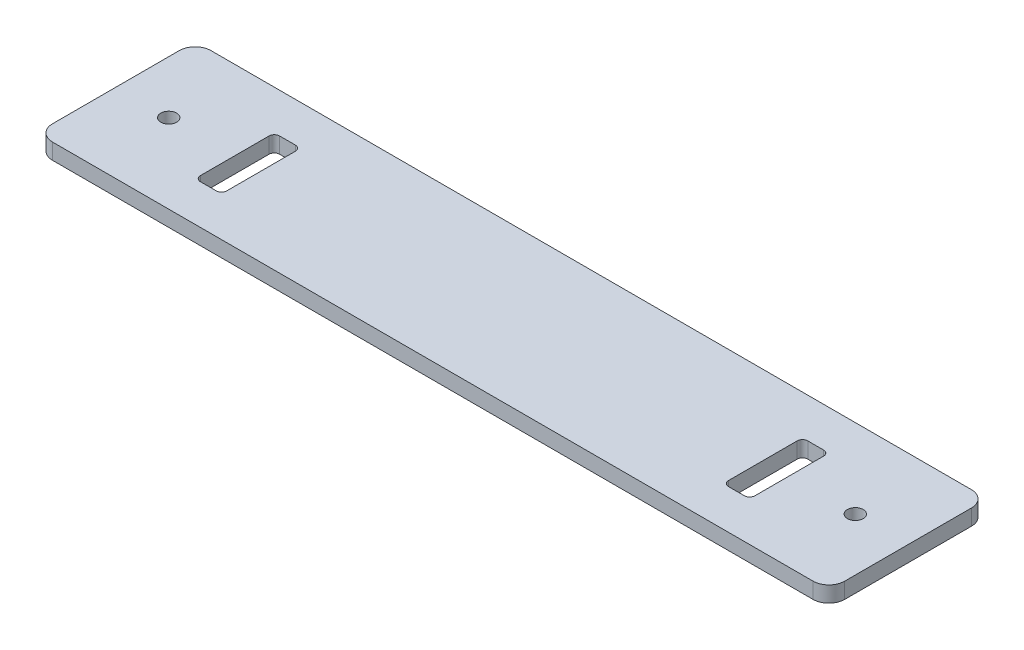
ISO-10303-21;
HEADER;
FILE_DESCRIPTION(('STEP AP214'),'2;1');
FILE_NAME('part.step','',(''),(''),'','','');
FILE_SCHEMA(('AUTOMOTIVE_DESIGN { 1 0 10303 214 1 1 1 1 }'));
ENDSEC;
DATA;
#1=APPLICATION_CONTEXT('core data for automotive mechanical design processes');
#2=APPLICATION_PROTOCOL_DEFINITION('international standard','automotive_design',2000,#1);
#3=PRODUCT_CONTEXT('',#1,'mechanical');
#4=PRODUCT('Part','Part','',(#3));
#5=PRODUCT_RELATED_PRODUCT_CATEGORY('part','',(#4));
#6=PRODUCT_DEFINITION_FORMATION('','',#4);
#7=PRODUCT_DEFINITION_CONTEXT('part definition',#1,'design');
#8=PRODUCT_DEFINITION('design','',#6,#7);
#9=PRODUCT_DEFINITION_SHAPE('','',#8);
#10=(LENGTH_UNIT() NAMED_UNIT(*) SI_UNIT(.MILLI.,.METRE.));
#11=(NAMED_UNIT(*) PLANE_ANGLE_UNIT() SI_UNIT($,.RADIAN.));
#12=(NAMED_UNIT(*) SI_UNIT($,.STERADIAN.) SOLID_ANGLE_UNIT());
#13=UNCERTAINTY_MEASURE_WITH_UNIT(LENGTH_MEASURE(1.E-05),#10,'distance_accuracy_value','');
#14=(GEOMETRIC_REPRESENTATION_CONTEXT(3) GLOBAL_UNCERTAINTY_ASSIGNED_CONTEXT((#13)) GLOBAL_UNIT_ASSIGNED_CONTEXT((#10,
#11,#12)) REPRESENTATION_CONTEXT('',''));
#15=CARTESIAN_POINT('',(0.,0.,0.));
#16=DIRECTION('',(0.,0.,1.));
#17=DIRECTION('',(1.,0.,0.));
#18=AXIS2_PLACEMENT_3D('',#15,#16,#17);
#19=CARTESIAN_POINT('',(-72.,3.,12.));
#20=DIRECTION('',(0.,-1.,0.));
#21=DIRECTION('',(0.,0.,-1.));
#22=AXIS2_PLACEMENT_3D('',#19,#20,#21);
#23=PLANE('',#22);
#24=CARTESIAN_POINT('',(48.5,3.,6.5));
#25=DIRECTION('',(0.,1.,0.));
#26=DIRECTION('',(0.,0.,-1.));
#27=AXIS2_PLACEMENT_3D('',#24,#25,#26);
#28=CIRCLE('',#27,0.999999999999994);
#29=CARTESIAN_POINT('',(47.5,3.,6.5));
#30=VERTEX_POINT('',#29);
#31=CARTESIAN_POINT('',(48.5,3.,7.5));
#32=VERTEX_POINT('',#31);
#33=EDGE_CURVE('E290',#30,#32,#28,.T.);
#34=ORIENTED_EDGE('',*,*,#33,.F.);
#35=DIRECTION('',(0.,0.,1.));
#36=VECTOR('',#35,1.);
#37=CARTESIAN_POINT('',(47.5,3.,6.5));
#38=LINE('',#37,#36);
#39=CARTESIAN_POINT('',(47.5,3.,-6.5));
#40=VERTEX_POINT('',#39);
#41=EDGE_CURVE('E313',#40,#30,#38,.T.);
#42=ORIENTED_EDGE('',*,*,#41,.F.);
#43=CARTESIAN_POINT('',(48.5,3.,-6.5));
#44=DIRECTION('',(0.,1.,0.));
#45=DIRECTION('',(0.,0.,1.));
#46=AXIS2_PLACEMENT_3D('',#43,#44,#45);
#47=CIRCLE('',#46,1.);
#48=CARTESIAN_POINT('',(48.5,3.,-7.5));
#49=VERTEX_POINT('',#48);
#50=EDGE_CURVE('E309',#49,#40,#47,.T.);
#51=ORIENTED_EDGE('',*,*,#50,.F.);
#52=DIRECTION('',(-1.,0.,0.));
#53=VECTOR('',#52,1.);
#54=CARTESIAN_POINT('',(51.5,3.,-7.5));
#55=LINE('',#54,#53);
#56=CARTESIAN_POINT('',(51.5,3.,-7.50000000000001));
#57=VERTEX_POINT('',#56);
#58=EDGE_CURVE('E306',#57,#49,#55,.T.);
#59=ORIENTED_EDGE('',*,*,#58,.F.);
#60=CARTESIAN_POINT('',(51.5,3.,-6.5));
#61=DIRECTION('',(0.,1.,0.));
#62=DIRECTION('',(0.,0.,1.));
#63=AXIS2_PLACEMENT_3D('',#60,#61,#62);
#64=CIRCLE('',#63,1.);
#65=CARTESIAN_POINT('',(52.5,3.,-6.5));
#66=VERTEX_POINT('',#65);
#67=EDGE_CURVE('E303',#66,#57,#64,.T.);
#68=ORIENTED_EDGE('',*,*,#67,.F.);
#69=DIRECTION('',(0.,0.,-1.));
#70=VECTOR('',#69,1.);
#71=CARTESIAN_POINT('',(52.5,3.,6.5));
#72=LINE('',#71,#70);
#73=CARTESIAN_POINT('',(52.5,3.,6.5));
#74=VERTEX_POINT('',#73);
#75=EDGE_CURVE('E300',#74,#66,#72,.T.);
#76=ORIENTED_EDGE('',*,*,#75,.F.);
#77=CARTESIAN_POINT('',(51.5,3.,6.5));
#78=DIRECTION('',(0.,1.,0.));
#79=DIRECTION('',(0.,0.,1.));
#80=AXIS2_PLACEMENT_3D('',#77,#78,#79);
#81=CIRCLE('',#80,1.);
#82=CARTESIAN_POINT('',(51.5,3.,7.5));
#83=VERTEX_POINT('',#82);
#84=EDGE_CURVE('E297',#83,#74,#81,.T.);
#85=ORIENTED_EDGE('',*,*,#84,.F.);
#86=DIRECTION('',(1.,0.,0.));
#87=VECTOR('',#86,1.);
#88=CARTESIAN_POINT('',(51.5,3.,7.5));
#89=LINE('',#88,#87);
#90=EDGE_CURVE('E293',#32,#83,#89,.T.);
#91=ORIENTED_EDGE('',*,*,#90,.F.);
#92=EDGE_LOOP('',(#34,#42,#51,#59,#68,#76,#85,#91));
#93=FACE_BOUND('',#92,.T.);
#94=CARTESIAN_POINT('',(-72.,3.,12.));
#95=DIRECTION('',(0.,1.,0.));
#96=DIRECTION('',(0.,0.,-1.));
#97=AXIS2_PLACEMENT_3D('',#94,#95,#96);
#98=CIRCLE('',#97,3.00000000000003);
#99=CARTESIAN_POINT('',(-75.,3.,12.));
#100=VERTEX_POINT('',#99);
#101=CARTESIAN_POINT('',(-72.,3.,15.));
#102=VERTEX_POINT('',#101);
#103=EDGE_CURVE('E389',#100,#102,#98,.T.);
#104=ORIENTED_EDGE('',*,*,#103,.T.);
#105=DIRECTION('',(1.,0.,0.));
#106=VECTOR('',#105,1.);
#107=CARTESIAN_POINT('',(72.,3.,15.));
#108=LINE('',#107,#106);
#109=CARTESIAN_POINT('',(72.,3.,15.));
#110=VERTEX_POINT('',#109);
#111=EDGE_CURVE('E393',#102,#110,#108,.T.);
#112=ORIENTED_EDGE('',*,*,#111,.T.);
#113=CARTESIAN_POINT('',(72.,3.,12.));
#114=DIRECTION('',(0.,1.,0.));
#115=DIRECTION('',(0.,0.,-1.));
#116=AXIS2_PLACEMENT_3D('',#113,#114,#115);
#117=CIRCLE('',#116,3.00000000000003);
#118=CARTESIAN_POINT('',(75.,3.,12.));
#119=VERTEX_POINT('',#118);
#120=EDGE_CURVE('E397',#110,#119,#117,.T.);
#121=ORIENTED_EDGE('',*,*,#120,.T.);
#122=DIRECTION('',(0.,0.,-1.));
#123=VECTOR('',#122,1.);
#124=CARTESIAN_POINT('',(75.,3.,-12.));
#125=LINE('',#124,#123);
#126=CARTESIAN_POINT('',(75.,3.,-12.));
#127=VERTEX_POINT('',#126);
#128=EDGE_CURVE('E400',#119,#127,#125,.T.);
#129=ORIENTED_EDGE('',*,*,#128,.T.);
#130=CARTESIAN_POINT('',(72.,3.,-12.));
#131=DIRECTION('',(0.,1.,0.));
#132=DIRECTION('',(0.,0.,-1.));
#133=AXIS2_PLACEMENT_3D('',#130,#131,#132);
#134=CIRCLE('',#133,3.00000000000003);
#135=CARTESIAN_POINT('',(72.,3.,-15.));
#136=VERTEX_POINT('',#135);
#137=EDGE_CURVE('E403',#127,#136,#134,.T.);
#138=ORIENTED_EDGE('',*,*,#137,.T.);
#139=DIRECTION('',(-1.,0.,0.));
#140=VECTOR('',#139,1.);
#141=CARTESIAN_POINT('',(72.,3.,-15.));
#142=LINE('',#141,#140);
#143=CARTESIAN_POINT('',(-72.,3.,-15.));
#144=VERTEX_POINT('',#143);
#145=EDGE_CURVE('E406',#136,#144,#142,.T.);
#146=ORIENTED_EDGE('',*,*,#145,.T.);
#147=CARTESIAN_POINT('',(-72.,3.,-12.));
#148=DIRECTION('',(0.,1.,0.));
#149=DIRECTION('',(0.,0.,1.));
#150=AXIS2_PLACEMENT_3D('',#147,#148,#149);
#151=CIRCLE('',#150,3.00000000000005);
#152=CARTESIAN_POINT('',(-75.,3.,-12.));
#153=VERTEX_POINT('',#152);
#154=EDGE_CURVE('E409',#144,#153,#151,.T.);
#155=ORIENTED_EDGE('',*,*,#154,.T.);
#156=DIRECTION('',(0.,0.,1.));
#157=VECTOR('',#156,1.);
#158=CARTESIAN_POINT('',(-75.,3.,-12.));
#159=LINE('',#158,#157);
#160=EDGE_CURVE('E412',#153,#100,#159,.T.);
#161=ORIENTED_EDGE('',*,*,#160,.T.);
#162=EDGE_LOOP('',(#104,#112,#121,#129,#138,#146,#155,#161));
#163=FACE_BOUND('',#162,.T.);
#164=CARTESIAN_POINT('',(65.,3.,0.));
#165=DIRECTION('',(0.,1.,0.));
#166=DIRECTION('',(0.,0.,1.));
#167=AXIS2_PLACEMENT_3D('',#164,#165,#166);
#168=CIRCLE('',#167,1.5);
#169=CARTESIAN_POINT('',(65.,3.,1.5));
#170=VERTEX_POINT('',#169);
#171=EDGE_CURVE('E381',#170,#170,#168,.T.);
#172=ORIENTED_EDGE('',*,*,#171,.F.);
#173=EDGE_LOOP('',(#172));
#174=FACE_BOUND('',#173,.T.);
#175=CARTESIAN_POINT('',(-65.,3.,0.));
#176=DIRECTION('',(0.,1.,0.));
#177=DIRECTION('',(0.,0.,-1.));
#178=AXIS2_PLACEMENT_3D('',#175,#176,#177);
#179=CIRCLE('',#178,1.5);
#180=CARTESIAN_POINT('',(-65.,3.,-1.49999999999998));
#181=VERTEX_POINT('',#180);
#182=EDGE_CURVE('E373',#181,#181,#179,.T.);
#183=ORIENTED_EDGE('',*,*,#182,.F.);
#184=EDGE_LOOP('',(#183));
#185=FACE_BOUND('',#184,.T.);
#186=CARTESIAN_POINT('',(-51.5,3.,-6.49999999999999));
#187=DIRECTION('',(0.,1.,0.));
#188=DIRECTION('',(0.,0.,-1.));
#189=AXIS2_PLACEMENT_3D('',#186,#187,#188);
#190=CIRCLE('',#189,1.);
#191=CARTESIAN_POINT('',(-51.5,3.,-7.49999999999999));
#192=VERTEX_POINT('',#191);
#193=CARTESIAN_POINT('',(-52.5,3.,-6.49999999999999));
#194=VERTEX_POINT('',#193);
#195=EDGE_CURVE('E201',#192,#194,#190,.T.);
#196=ORIENTED_EDGE('',*,*,#195,.F.);
#197=DIRECTION('',(-1.,0.,0.));
#198=VECTOR('',#197,1.);
#199=CARTESIAN_POINT('',(-51.5,3.,-7.49999999999999));
#200=LINE('',#199,#198);
#201=CARTESIAN_POINT('',(-48.5,3.,-7.49999999999999));
#202=VERTEX_POINT('',#201);
#203=EDGE_CURVE('E242',#202,#192,#200,.T.);
#204=ORIENTED_EDGE('',*,*,#203,.F.);
#205=CARTESIAN_POINT('',(-48.5,3.,-6.49999999999999));
#206=DIRECTION('',(0.,1.,0.));
#207=DIRECTION('',(0.,0.,-1.));
#208=AXIS2_PLACEMENT_3D('',#205,#206,#207);
#209=CIRCLE('',#208,1.);
#210=CARTESIAN_POINT('',(-47.5,3.,-6.49999999999999));
#211=VERTEX_POINT('',#210);
#212=EDGE_CURVE('E239',#211,#202,#209,.T.);
#213=ORIENTED_EDGE('',*,*,#212,.F.);
#214=DIRECTION('',(0.,0.,-1.));
#215=VECTOR('',#214,1.);
#216=CARTESIAN_POINT('',(-47.5,3.,6.50000000000001));
#217=LINE('',#216,#215);
#218=CARTESIAN_POINT('',(-47.5,3.,6.50000000000001));
#219=VERTEX_POINT('',#218);
#220=EDGE_CURVE('E236',#219,#211,#217,.T.);
#221=ORIENTED_EDGE('',*,*,#220,.F.);
#222=CARTESIAN_POINT('',(-48.5,3.,6.50000000000001));
#223=DIRECTION('',(0.,1.,0.));
#224=DIRECTION('',(0.,0.,1.));
#225=AXIS2_PLACEMENT_3D('',#222,#223,#224);
#226=CIRCLE('',#225,0.999999999999994);
#227=CARTESIAN_POINT('',(-48.5,3.,7.50000000000001));
#228=VERTEX_POINT('',#227);
#229=EDGE_CURVE('E233',#228,#219,#226,.T.);
#230=ORIENTED_EDGE('',*,*,#229,.F.);
#231=DIRECTION('',(1.,0.,0.));
#232=VECTOR('',#231,1.);
#233=CARTESIAN_POINT('',(-51.5,3.,7.50000000000001));
#234=LINE('',#233,#232);
#235=CARTESIAN_POINT('',(-51.5,3.,7.50000000000002));
#236=VERTEX_POINT('',#235);
#237=EDGE_CURVE('E228',#236,#228,#234,.T.);
#238=ORIENTED_EDGE('',*,*,#237,.F.);
#239=CARTESIAN_POINT('',(-51.5,3.,6.50000000000001));
#240=DIRECTION('',(0.,1.,0.));
#241=DIRECTION('',(0.,0.,-1.));
#242=AXIS2_PLACEMENT_3D('',#239,#240,#241);
#243=CIRCLE('',#242,1.);
#244=CARTESIAN_POINT('',(-52.5,3.,6.50000000000001));
#245=VERTEX_POINT('',#244);
#246=EDGE_CURVE('E224',#245,#236,#243,.T.);
#247=ORIENTED_EDGE('',*,*,#246,.F.);
#248=DIRECTION('',(0.,0.,1.));
#249=VECTOR('',#248,1.);
#250=CARTESIAN_POINT('',(-52.5,3.,6.50000000000001));
#251=LINE('',#250,#249);
#252=EDGE_CURVE('E210',#194,#245,#251,.T.);
#253=ORIENTED_EDGE('',*,*,#252,.F.);
#254=EDGE_LOOP('',(#196,#204,#213,#221,#230,#238,#247,#253));
#255=FACE_BOUND('',#254,.T.);
#256=ADVANCED_FACE('F39',(#93,#163,#174,#185,#255),#23,.F.);
#257=CARTESIAN_POINT('',(-72.,0.,12.));
#258=DIRECTION('',(0.,-1.,0.));
#259=DIRECTION('',(0.,0.,-1.));
#260=AXIS2_PLACEMENT_3D('',#257,#258,#259);
#261=PLANE('',#260);
#262=CARTESIAN_POINT('',(65.,0.,0.));
#263=DIRECTION('',(0.,1.,0.));
#264=DIRECTION('',(0.,0.,1.));
#265=AXIS2_PLACEMENT_3D('',#262,#263,#264);
#266=CIRCLE('',#265,1.5);
#267=CARTESIAN_POINT('',(65.,0.,1.5));
#268=VERTEX_POINT('',#267);
#269=EDGE_CURVE('E377',#268,#268,#266,.T.);
#270=ORIENTED_EDGE('',*,*,#269,.T.);
#271=EDGE_LOOP('',(#270));
#272=FACE_BOUND('',#271,.T.);
#273=CARTESIAN_POINT('',(-72.,0.,12.));
#274=DIRECTION('',(0.,1.,0.));
#275=DIRECTION('',(0.,0.,-1.));
#276=AXIS2_PLACEMENT_3D('',#273,#274,#275);
#277=CIRCLE('',#276,3.00000000000003);
#278=CARTESIAN_POINT('',(-75.,0.,12.));
#279=VERTEX_POINT('',#278);
#280=CARTESIAN_POINT('',(-72.,0.,15.));
#281=VERTEX_POINT('',#280);
#282=EDGE_CURVE('E385',#279,#281,#277,.T.);
#283=ORIENTED_EDGE('',*,*,#282,.F.);
#284=DIRECTION('',(0.,0.,1.));
#285=VECTOR('',#284,1.);
#286=CARTESIAN_POINT('',(-75.,0.,-12.));
#287=LINE('',#286,#285);
#288=CARTESIAN_POINT('',(-75.,0.,-12.));
#289=VERTEX_POINT('',#288);
#290=EDGE_CURVE('E394',#289,#279,#287,.T.);
#291=ORIENTED_EDGE('',*,*,#290,.F.);
#292=CARTESIAN_POINT('',(-72.,0.,-12.));
#293=DIRECTION('',(0.,1.,0.));
#294=DIRECTION('',(0.,0.,1.));
#295=AXIS2_PLACEMENT_3D('',#292,#293,#294);
#296=CIRCLE('',#295,3.00000000000005);
#297=CARTESIAN_POINT('',(-72.,0.,-15.));
#298=VERTEX_POINT('',#297);
#299=EDGE_CURVE('E434',#298,#289,#296,.T.);
#300=ORIENTED_EDGE('',*,*,#299,.F.);
#301=DIRECTION('',(-1.,0.,0.));
#302=VECTOR('',#301,1.);
#303=CARTESIAN_POINT('',(72.,0.,-15.));
#304=LINE('',#303,#302);
#305=CARTESIAN_POINT('',(72.,0.,-15.));
#306=VERTEX_POINT('',#305);
#307=EDGE_CURVE('E431',#306,#298,#304,.T.);
#308=ORIENTED_EDGE('',*,*,#307,.F.);
#309=CARTESIAN_POINT('',(72.,0.,-12.));
#310=DIRECTION('',(0.,1.,0.));
#311=DIRECTION('',(0.,0.,-1.));
#312=AXIS2_PLACEMENT_3D('',#309,#310,#311);
#313=CIRCLE('',#312,3.00000000000003);
#314=CARTESIAN_POINT('',(75.,0.,-12.));
#315=VERTEX_POINT('',#314);
#316=EDGE_CURVE('E428',#315,#306,#313,.T.);
#317=ORIENTED_EDGE('',*,*,#316,.F.);
#318=DIRECTION('',(0.,0.,-1.));
#319=VECTOR('',#318,1.);
#320=CARTESIAN_POINT('',(75.,0.,-12.));
#321=LINE('',#320,#319);
#322=CARTESIAN_POINT('',(75.,0.,12.));
#323=VERTEX_POINT('',#322);
#324=EDGE_CURVE('E425',#323,#315,#321,.T.);
#325=ORIENTED_EDGE('',*,*,#324,.F.);
#326=CARTESIAN_POINT('',(72.,0.,12.));
#327=DIRECTION('',(0.,1.,0.));
#328=DIRECTION('',(0.,0.,-1.));
#329=AXIS2_PLACEMENT_3D('',#326,#327,#328);
#330=CIRCLE('',#329,3.00000000000003);
#331=CARTESIAN_POINT('',(72.,0.,15.));
#332=VERTEX_POINT('',#331);
#333=EDGE_CURVE('E422',#332,#323,#330,.T.);
#334=ORIENTED_EDGE('',*,*,#333,.F.);
#335=DIRECTION('',(1.,0.,0.));
#336=VECTOR('',#335,1.);
#337=CARTESIAN_POINT('',(72.,0.,15.));
#338=LINE('',#337,#336);
#339=EDGE_CURVE('E419',#281,#332,#338,.T.);
#340=ORIENTED_EDGE('',*,*,#339,.F.);
#341=EDGE_LOOP('',(#283,#291,#300,#308,#317,#325,#334,#340));
#342=FACE_BOUND('',#341,.T.);
#343=CARTESIAN_POINT('',(-65.,0.,0.));
#344=DIRECTION('',(0.,1.,0.));
#345=DIRECTION('',(0.,0.,-1.));
#346=AXIS2_PLACEMENT_3D('',#343,#344,#345);
#347=CIRCLE('',#346,1.5);
#348=CARTESIAN_POINT('',(-65.,0.,-1.49999999999998));
#349=VERTEX_POINT('',#348);
#350=EDGE_CURVE('E372',#349,#349,#347,.T.);
#351=ORIENTED_EDGE('',*,*,#350,.T.);
#352=EDGE_LOOP('',(#351));
#353=FACE_BOUND('',#352,.T.);
#354=DIRECTION('',(0.,0.,1.));
#355=VECTOR('',#354,1.);
#356=CARTESIAN_POINT('',(47.5,0.,6.5));
#357=LINE('',#356,#355);
#358=CARTESIAN_POINT('',(47.5,0.,-6.5));
#359=VERTEX_POINT('',#358);
#360=CARTESIAN_POINT('',(47.5,0.,6.5));
#361=VERTEX_POINT('',#360);
#362=EDGE_CURVE('E294',#359,#361,#357,.T.);
#363=ORIENTED_EDGE('',*,*,#362,.T.);
#364=CARTESIAN_POINT('',(48.5,0.,6.5));
#365=DIRECTION('',(0.,1.,0.));
#366=DIRECTION('',(0.,0.,-1.));
#367=AXIS2_PLACEMENT_3D('',#364,#365,#366);
#368=CIRCLE('',#367,0.999999999999994);
#369=CARTESIAN_POINT('',(48.5,0.,7.5));
#370=VERTEX_POINT('',#369);
#371=EDGE_CURVE('E219',#361,#370,#368,.T.);
#372=ORIENTED_EDGE('',*,*,#371,.T.);
#373=DIRECTION('',(1.,0.,0.));
#374=VECTOR('',#373,1.);
#375=CARTESIAN_POINT('',(51.5,0.,7.5));
#376=LINE('',#375,#374);
#377=CARTESIAN_POINT('',(51.5,0.,7.5));
#378=VERTEX_POINT('',#377);
#379=EDGE_CURVE('E320',#370,#378,#376,.T.);
#380=ORIENTED_EDGE('',*,*,#379,.T.);
#381=CARTESIAN_POINT('',(51.5,0.,6.5));
#382=DIRECTION('',(0.,1.,0.));
#383=DIRECTION('',(0.,0.,1.));
#384=AXIS2_PLACEMENT_3D('',#381,#382,#383);
#385=CIRCLE('',#384,1.);
#386=CARTESIAN_POINT('',(52.5,0.,6.5));
#387=VERTEX_POINT('',#386);
#388=EDGE_CURVE('E324',#378,#387,#385,.T.);
#389=ORIENTED_EDGE('',*,*,#388,.T.);
#390=DIRECTION('',(0.,0.,-1.));
#391=VECTOR('',#390,1.);
#392=CARTESIAN_POINT('',(52.5,0.,6.5));
#393=LINE('',#392,#391);
#394=CARTESIAN_POINT('',(52.5,0.,-6.5));
#395=VERTEX_POINT('',#394);
#396=EDGE_CURVE('E328',#387,#395,#393,.T.);
#397=ORIENTED_EDGE('',*,*,#396,.T.);
#398=CARTESIAN_POINT('',(51.5,0.,-6.5));
#399=DIRECTION('',(0.,1.,0.));
#400=DIRECTION('',(0.,0.,1.));
#401=AXIS2_PLACEMENT_3D('',#398,#399,#400);
#402=CIRCLE('',#401,1.);
#403=CARTESIAN_POINT('',(51.5,0.,-7.50000000000001));
#404=VERTEX_POINT('',#403);
#405=EDGE_CURVE('E332',#395,#404,#402,.T.);
#406=ORIENTED_EDGE('',*,*,#405,.T.);
#407=DIRECTION('',(-1.,0.,0.));
#408=VECTOR('',#407,1.);
#409=CARTESIAN_POINT('',(51.5,0.,-7.5));
#410=LINE('',#409,#408);
#411=CARTESIAN_POINT('',(48.5,0.,-7.5));
#412=VERTEX_POINT('',#411);
#413=EDGE_CURVE('E336',#404,#412,#410,.T.);
#414=ORIENTED_EDGE('',*,*,#413,.T.);
#415=CARTESIAN_POINT('',(48.5,0.,-6.5));
#416=DIRECTION('',(0.,1.,0.));
#417=DIRECTION('',(0.,0.,1.));
#418=AXIS2_PLACEMENT_3D('',#415,#416,#417);
#419=CIRCLE('',#418,1.);
#420=EDGE_CURVE('E340',#412,#359,#419,.T.);
#421=ORIENTED_EDGE('',*,*,#420,.T.);
#422=EDGE_LOOP('',(#363,#372,#380,#389,#397,#406,#414,#421));
#423=FACE_BOUND('',#422,.T.);
#424=DIRECTION('',(-1.,0.,0.));
#425=VECTOR('',#424,1.);
#426=CARTESIAN_POINT('',(-51.5,0.,-7.49999999999999));
#427=LINE('',#426,#425);
#428=CARTESIAN_POINT('',(-48.5,0.,-7.49999999999999));
#429=VERTEX_POINT('',#428);
#430=CARTESIAN_POINT('',(-51.5,0.,-7.49999999999999));
#431=VERTEX_POINT('',#430);
#432=EDGE_CURVE('E211',#429,#431,#427,.T.);
#433=ORIENTED_EDGE('',*,*,#432,.T.);
#434=CARTESIAN_POINT('',(-51.5,0.,-6.49999999999999));
#435=DIRECTION('',(0.,1.,0.));
#436=DIRECTION('',(0.,0.,-1.));
#437=AXIS2_PLACEMENT_3D('',#434,#435,#436);
#438=CIRCLE('',#437,1.);
#439=CARTESIAN_POINT('',(-52.5,0.,-6.49999999999999));
#440=VERTEX_POINT('',#439);
#441=EDGE_CURVE('E63',#431,#440,#438,.T.);
#442=ORIENTED_EDGE('',*,*,#441,.T.);
#443=DIRECTION('',(0.,0.,1.));
#444=VECTOR('',#443,1.);
#445=CARTESIAN_POINT('',(-52.5,0.,6.50000000000001));
#446=LINE('',#445,#444);
#447=CARTESIAN_POINT('',(-52.5,0.,6.50000000000001));
#448=VERTEX_POINT('',#447);
#449=EDGE_CURVE('E217',#440,#448,#446,.T.);
#450=ORIENTED_EDGE('',*,*,#449,.T.);
#451=CARTESIAN_POINT('',(-51.5,0.,6.50000000000001));
#452=DIRECTION('',(0.,1.,0.));
#453=DIRECTION('',(0.,0.,-1.));
#454=AXIS2_PLACEMENT_3D('',#451,#452,#453);
#455=CIRCLE('',#454,1.);
#456=CARTESIAN_POINT('',(-51.5,0.,7.50000000000002));
#457=VERTEX_POINT('',#456);
#458=EDGE_CURVE('E249',#448,#457,#455,.T.);
#459=ORIENTED_EDGE('',*,*,#458,.T.);
#460=DIRECTION('',(1.,0.,0.));
#461=VECTOR('',#460,1.);
#462=CARTESIAN_POINT('',(-51.5,0.,7.50000000000001));
#463=LINE('',#462,#461);
#464=CARTESIAN_POINT('',(-48.5,0.,7.50000000000001));
#465=VERTEX_POINT('',#464);
#466=EDGE_CURVE('E253',#457,#465,#463,.T.);
#467=ORIENTED_EDGE('',*,*,#466,.T.);
#468=CARTESIAN_POINT('',(-48.5,0.,6.50000000000001));
#469=DIRECTION('',(0.,1.,0.));
#470=DIRECTION('',(0.,0.,1.));
#471=AXIS2_PLACEMENT_3D('',#468,#469,#470);
#472=CIRCLE('',#471,0.999999999999994);
#473=CARTESIAN_POINT('',(-47.5,0.,6.50000000000001));
#474=VERTEX_POINT('',#473);
#475=EDGE_CURVE('E257',#465,#474,#472,.T.);
#476=ORIENTED_EDGE('',*,*,#475,.T.);
#477=DIRECTION('',(0.,0.,-1.));
#478=VECTOR('',#477,1.);
#479=CARTESIAN_POINT('',(-47.5,0.,6.50000000000001));
#480=LINE('',#479,#478);
#481=CARTESIAN_POINT('',(-47.5,0.,-6.49999999999999));
#482=VERTEX_POINT('',#481);
#483=EDGE_CURVE('E261',#474,#482,#480,.T.);
#484=ORIENTED_EDGE('',*,*,#483,.T.);
#485=CARTESIAN_POINT('',(-48.5,0.,-6.49999999999999));
#486=DIRECTION('',(0.,1.,0.));
#487=DIRECTION('',(0.,0.,-1.));
#488=AXIS2_PLACEMENT_3D('',#485,#486,#487);
#489=CIRCLE('',#488,1.);
#490=EDGE_CURVE('E265',#482,#429,#489,.T.);
#491=ORIENTED_EDGE('',*,*,#490,.T.);
#492=EDGE_LOOP('',(#433,#442,#450,#459,#467,#476,#484,#491));
#493=FACE_BOUND('',#492,.T.);
#494=ADVANCED_FACE('F473',(#272,#342,#353,#423,#493),#261,.T.);
#495=CARTESIAN_POINT('',(-72.,3.,12.));
#496=DIRECTION('',(0.,-1.,0.));
#497=DIRECTION('',(0.,0.,-1.));
#498=AXIS2_PLACEMENT_3D('',#495,#496,#497);
#499=CYLINDRICAL_SURFACE('',#498,3.00000000000003);
#500=ORIENTED_EDGE('',*,*,#282,.T.);
#501=DIRECTION('',(0.,-1.,0.));
#502=VECTOR('',#501,1.);
#503=CARTESIAN_POINT('',(-72.,3.,15.));
#504=LINE('',#503,#502);
#505=EDGE_CURVE('E11',#102,#281,#504,.T.);
#506=ORIENTED_EDGE('',*,*,#505,.F.);
#507=ORIENTED_EDGE('',*,*,#103,.F.);
#508=DIRECTION('',(0.,-1.,0.));
#509=VECTOR('',#508,1.);
#510=CARTESIAN_POINT('',(-75.,3.,12.));
#511=LINE('',#510,#509);
#512=EDGE_CURVE('E415',#100,#279,#511,.T.);
#513=ORIENTED_EDGE('',*,*,#512,.T.);
#514=EDGE_LOOP('',(#500,#506,#507,#513));
#515=FACE_BOUND('',#514,.T.);
#516=ADVANCED_FACE('F41',(#515),#499,.T.);
#517=CARTESIAN_POINT('',(72.,3.,15.));
#518=DIRECTION('',(0.,0.,-1.));
#519=DIRECTION('',(-1.,0.,0.));
#520=AXIS2_PLACEMENT_3D('',#517,#518,#519);
#521=PLANE('',#520);
#522=ORIENTED_EDGE('',*,*,#339,.T.);
#523=DIRECTION('',(0.,-1.,0.));
#524=VECTOR('',#523,1.);
#525=CARTESIAN_POINT('',(72.,3.,15.));
#526=LINE('',#525,#524);
#527=EDGE_CURVE('E48',#110,#332,#526,.T.);
#528=ORIENTED_EDGE('',*,*,#527,.F.);
#529=ORIENTED_EDGE('',*,*,#111,.F.);
#530=ORIENTED_EDGE('',*,*,#505,.T.);
#531=EDGE_LOOP('',(#522,#528,#529,#530));
#532=FACE_BOUND('',#531,.T.);
#533=ADVANCED_FACE('F491',(#532),#521,.F.);
#534=CARTESIAN_POINT('',(72.,3.,12.));
#535=DIRECTION('',(0.,-1.,0.));
#536=DIRECTION('',(0.,0.,-1.));
#537=AXIS2_PLACEMENT_3D('',#534,#535,#536);
#538=CYLINDRICAL_SURFACE('',#537,3.00000000000003);
#539=ORIENTED_EDGE('',*,*,#333,.T.);
#540=DIRECTION('',(0.,-1.,0.));
#541=VECTOR('',#540,1.);
#542=CARTESIAN_POINT('',(75.,3.,12.));
#543=LINE('',#542,#541);
#544=EDGE_CURVE('E458',#119,#323,#543,.T.);
#545=ORIENTED_EDGE('',*,*,#544,.F.);
#546=ORIENTED_EDGE('',*,*,#120,.F.);
#547=ORIENTED_EDGE('',*,*,#527,.T.);
#548=EDGE_LOOP('',(#539,#545,#546,#547));
#549=FACE_BOUND('',#548,.T.);
#550=ADVANCED_FACE('F467',(#549),#538,.T.);
#551=CARTESIAN_POINT('',(75.,3.,-12.));
#552=DIRECTION('',(-1.,0.,0.));
#553=DIRECTION('',(0.,0.,1.));
#554=AXIS2_PLACEMENT_3D('',#551,#552,#553);
#555=PLANE('',#554);
#556=ORIENTED_EDGE('',*,*,#324,.T.);
#557=DIRECTION('',(0.,-1.,0.));
#558=VECTOR('',#557,1.);
#559=CARTESIAN_POINT('',(75.,3.,-12.));
#560=LINE('',#559,#558);
#561=EDGE_CURVE('E454',#127,#315,#560,.T.);
#562=ORIENTED_EDGE('',*,*,#561,.F.);
#563=ORIENTED_EDGE('',*,*,#128,.F.);
#564=ORIENTED_EDGE('',*,*,#544,.T.);
#565=EDGE_LOOP('',(#556,#562,#563,#564));
#566=FACE_BOUND('',#565,.T.);
#567=ADVANCED_FACE('F479',(#566),#555,.F.);
#568=CARTESIAN_POINT('',(72.,3.,-12.));
#569=DIRECTION('',(0.,-1.,0.));
#570=DIRECTION('',(0.,0.,-1.));
#571=AXIS2_PLACEMENT_3D('',#568,#569,#570);
#572=CYLINDRICAL_SURFACE('',#571,3.00000000000003);
#573=ORIENTED_EDGE('',*,*,#316,.T.);
#574=DIRECTION('',(0.,-1.,0.));
#575=VECTOR('',#574,1.);
#576=CARTESIAN_POINT('',(72.,3.,-15.));
#577=LINE('',#576,#575);
#578=EDGE_CURVE('E450',#136,#306,#577,.T.);
#579=ORIENTED_EDGE('',*,*,#578,.F.);
#580=ORIENTED_EDGE('',*,*,#137,.F.);
#581=ORIENTED_EDGE('',*,*,#561,.T.);
#582=EDGE_LOOP('',(#573,#579,#580,#581));
#583=FACE_BOUND('',#582,.T.);
#584=ADVANCED_FACE('F483',(#583),#572,.T.);
#585=CARTESIAN_POINT('',(72.,3.,-15.));
#586=DIRECTION('',(0.,0.,1.));
#587=DIRECTION('',(1.,0.,0.));
#588=AXIS2_PLACEMENT_3D('',#585,#586,#587);
#589=PLANE('',#588);
#590=ORIENTED_EDGE('',*,*,#307,.T.);
#591=DIRECTION('',(0.,-1.,0.));
#592=VECTOR('',#591,1.);
#593=CARTESIAN_POINT('',(-72.,3.,-15.));
#594=LINE('',#593,#592);
#595=EDGE_CURVE('E446',#144,#298,#594,.T.);
#596=ORIENTED_EDGE('',*,*,#595,.F.);
#597=ORIENTED_EDGE('',*,*,#145,.F.);
#598=ORIENTED_EDGE('',*,*,#578,.T.);
#599=EDGE_LOOP('',(#590,#596,#597,#598));
#600=FACE_BOUND('',#599,.T.);
#601=ADVANCED_FACE('F504',(#600),#589,.F.);
#602=CARTESIAN_POINT('',(-72.,3.,-12.));
#603=DIRECTION('',(0.,-1.,0.));
#604=DIRECTION('',(0.,0.,-1.));
#605=AXIS2_PLACEMENT_3D('',#602,#603,#604);
#606=CYLINDRICAL_SURFACE('',#605,3.00000000000005);
#607=ORIENTED_EDGE('',*,*,#299,.T.);
#608=DIRECTION('',(0.,-1.,0.));
#609=VECTOR('',#608,1.);
#610=CARTESIAN_POINT('',(-75.,3.,-12.));
#611=LINE('',#610,#609);
#612=EDGE_CURVE('E442',#153,#289,#611,.T.);
#613=ORIENTED_EDGE('',*,*,#612,.F.);
#614=ORIENTED_EDGE('',*,*,#154,.F.);
#615=ORIENTED_EDGE('',*,*,#595,.T.);
#616=EDGE_LOOP('',(#607,#613,#614,#615));
#617=FACE_BOUND('',#616,.T.);
#618=ADVANCED_FACE('F502',(#617),#606,.T.);
#619=CARTESIAN_POINT('',(-75.,3.,-12.));
#620=DIRECTION('',(1.,0.,0.));
#621=DIRECTION('',(0.,0.,-1.));
#622=AXIS2_PLACEMENT_3D('',#619,#620,#621);
#623=PLANE('',#622);
#624=ORIENTED_EDGE('',*,*,#290,.T.);
#625=ORIENTED_EDGE('',*,*,#512,.F.);
#626=ORIENTED_EDGE('',*,*,#160,.F.);
#627=ORIENTED_EDGE('',*,*,#612,.T.);
#628=EDGE_LOOP('',(#624,#625,#626,#627));
#629=FACE_BOUND('',#628,.T.);
#630=ADVANCED_FACE('F497',(#629),#623,.F.);
#631=CARTESIAN_POINT('',(65.,3.,0.));
#632=DIRECTION('',(0.,-1.,0.));
#633=DIRECTION('',(0.,0.,-1.));
#634=AXIS2_PLACEMENT_3D('',#631,#632,#633);
#635=CYLINDRICAL_SURFACE('',#634,1.5);
#636=ORIENTED_EDGE('',*,*,#171,.T.);
#637=EDGE_LOOP('',(#636));
#638=FACE_BOUND('',#637,.T.);
#639=ORIENTED_EDGE('',*,*,#269,.F.);
#640=EDGE_LOOP('',(#639));
#641=FACE_BOUND('',#640,.T.);
#642=ADVANCED_FACE('F523',(#638,#641),#635,.F.);
#643=CARTESIAN_POINT('',(-65.,3.,0.));
#644=DIRECTION('',(0.,-1.,0.));
#645=DIRECTION('',(0.,0.,-1.));
#646=AXIS2_PLACEMENT_3D('',#643,#644,#645);
#647=CYLINDRICAL_SURFACE('',#646,1.5);
#648=ORIENTED_EDGE('',*,*,#182,.T.);
#649=EDGE_LOOP('',(#648));
#650=FACE_BOUND('',#649,.T.);
#651=ORIENTED_EDGE('',*,*,#350,.F.);
#652=EDGE_LOOP('',(#651));
#653=FACE_BOUND('',#652,.T.);
#654=ADVANCED_FACE('F530',(#650,#653),#647,.F.);
#655=CARTESIAN_POINT('',(48.5,3.,6.5));
#656=DIRECTION('',(0.,-1.,0.));
#657=DIRECTION('',(0.,0.,-1.));
#658=AXIS2_PLACEMENT_3D('',#655,#656,#657);
#659=CYLINDRICAL_SURFACE('',#658,0.999999999999994);
#660=ORIENTED_EDGE('',*,*,#371,.F.);
#661=DIRECTION('',(0.,-1.,0.));
#662=VECTOR('',#661,1.);
#663=CARTESIAN_POINT('',(47.5,3.,6.5));
#664=LINE('',#663,#662);
#665=EDGE_CURVE('E316',#30,#361,#664,.T.);
#666=ORIENTED_EDGE('',*,*,#665,.F.);
#667=ORIENTED_EDGE('',*,*,#33,.T.);
#668=DIRECTION('',(0.,-1.,0.));
#669=VECTOR('',#668,1.);
#670=CARTESIAN_POINT('',(48.5,3.,7.5));
#671=LINE('',#670,#669);
#672=EDGE_CURVE('E368',#32,#370,#671,.T.);
#673=ORIENTED_EDGE('',*,*,#672,.T.);
#674=EDGE_LOOP('',(#660,#666,#667,#673));
#675=FACE_BOUND('',#674,.T.);
#676=ADVANCED_FACE('F535',(#675),#659,.F.);
#677=CARTESIAN_POINT('',(51.5,3.,7.5));
#678=DIRECTION('',(0.,0.,-1.));
#679=DIRECTION('',(-1.,0.,0.));
#680=AXIS2_PLACEMENT_3D('',#677,#678,#679);
#681=PLANE('',#680);
#682=ORIENTED_EDGE('',*,*,#379,.F.);
#683=ORIENTED_EDGE('',*,*,#672,.F.);
#684=ORIENTED_EDGE('',*,*,#90,.T.);
#685=DIRECTION('',(0.,-1.,0.));
#686=VECTOR('',#685,1.);
#687=CARTESIAN_POINT('',(51.5,3.,7.5));
#688=LINE('',#687,#686);
#689=EDGE_CURVE('E365',#83,#378,#688,.T.);
#690=ORIENTED_EDGE('',*,*,#689,.T.);
#691=EDGE_LOOP('',(#682,#683,#684,#690));
#692=FACE_BOUND('',#691,.T.);
#693=ADVANCED_FACE('F605',(#692),#681,.T.);
#694=CARTESIAN_POINT('',(51.5,3.,6.5));
#695=DIRECTION('',(0.,-1.,0.));
#696=DIRECTION('',(0.,0.,-1.));
#697=AXIS2_PLACEMENT_3D('',#694,#695,#696);
#698=CYLINDRICAL_SURFACE('',#697,1.);
#699=ORIENTED_EDGE('',*,*,#388,.F.);
#700=ORIENTED_EDGE('',*,*,#689,.F.);
#701=ORIENTED_EDGE('',*,*,#84,.T.);
#702=DIRECTION('',(0.,-1.,0.));
#703=VECTOR('',#702,1.);
#704=CARTESIAN_POINT('',(52.5,3.,6.5));
#705=LINE('',#704,#703);
#706=EDGE_CURVE('E362',#74,#387,#705,.T.);
#707=ORIENTED_EDGE('',*,*,#706,.T.);
#708=EDGE_LOOP('',(#699,#700,#701,#707));
#709=FACE_BOUND('',#708,.T.);
#710=ADVANCED_FACE('F601',(#709),#698,.F.);
#711=CARTESIAN_POINT('',(52.5,3.,6.5));
#712=DIRECTION('',(-1.,0.,0.));
#713=DIRECTION('',(0.,0.,1.));
#714=AXIS2_PLACEMENT_3D('',#711,#712,#713);
#715=PLANE('',#714);
#716=ORIENTED_EDGE('',*,*,#396,.F.);
#717=ORIENTED_EDGE('',*,*,#706,.F.);
#718=ORIENTED_EDGE('',*,*,#75,.T.);
#719=DIRECTION('',(0.,-1.,0.));
#720=VECTOR('',#719,1.);
#721=CARTESIAN_POINT('',(52.5,3.,-6.5));
#722=LINE('',#721,#720);
#723=EDGE_CURVE('E359',#66,#395,#722,.T.);
#724=ORIENTED_EDGE('',*,*,#723,.T.);
#725=EDGE_LOOP('',(#716,#717,#718,#724));
#726=FACE_BOUND('',#725,.T.);
#727=ADVANCED_FACE('F597',(#726),#715,.T.);
#728=CARTESIAN_POINT('',(51.5,3.,-6.5));
#729=DIRECTION('',(0.,-1.,0.));
#730=DIRECTION('',(0.,0.,-1.));
#731=AXIS2_PLACEMENT_3D('',#728,#729,#730);
#732=CYLINDRICAL_SURFACE('',#731,1.);
#733=ORIENTED_EDGE('',*,*,#405,.F.);
#734=ORIENTED_EDGE('',*,*,#723,.F.);
#735=ORIENTED_EDGE('',*,*,#67,.T.);
#736=DIRECTION('',(0.,-1.,0.));
#737=VECTOR('',#736,1.);
#738=CARTESIAN_POINT('',(51.5,3.,-7.50000000000001));
#739=LINE('',#738,#737);
#740=EDGE_CURVE('E356',#57,#404,#739,.T.);
#741=ORIENTED_EDGE('',*,*,#740,.T.);
#742=EDGE_LOOP('',(#733,#734,#735,#741));
#743=FACE_BOUND('',#742,.T.);
#744=ADVANCED_FACE('F593',(#743),#732,.F.);
#745=CARTESIAN_POINT('',(51.5,3.,-7.5));
#746=DIRECTION('',(0.,0.,1.));
#747=DIRECTION('',(1.,0.,0.));
#748=AXIS2_PLACEMENT_3D('',#745,#746,#747);
#749=PLANE('',#748);
#750=ORIENTED_EDGE('',*,*,#413,.F.);
#751=ORIENTED_EDGE('',*,*,#740,.F.);
#752=ORIENTED_EDGE('',*,*,#58,.T.);
#753=DIRECTION('',(0.,-1.,0.));
#754=VECTOR('',#753,1.);
#755=CARTESIAN_POINT('',(48.5,3.,-7.5));
#756=LINE('',#755,#754);
#757=EDGE_CURVE('E353',#49,#412,#756,.T.);
#758=ORIENTED_EDGE('',*,*,#757,.T.);
#759=EDGE_LOOP('',(#750,#751,#752,#758));
#760=FACE_BOUND('',#759,.T.);
#761=ADVANCED_FACE('F589',(#760),#749,.T.);
#762=CARTESIAN_POINT('',(48.5,3.,-6.5));
#763=DIRECTION('',(0.,-1.,0.));
#764=DIRECTION('',(0.,0.,-1.));
#765=AXIS2_PLACEMENT_3D('',#762,#763,#764);
#766=CYLINDRICAL_SURFACE('',#765,1.);
#767=ORIENTED_EDGE('',*,*,#420,.F.);
#768=ORIENTED_EDGE('',*,*,#757,.F.);
#769=ORIENTED_EDGE('',*,*,#50,.T.);
#770=DIRECTION('',(0.,-1.,0.));
#771=VECTOR('',#770,1.);
#772=CARTESIAN_POINT('',(47.5,3.,-6.5));
#773=LINE('',#772,#771);
#774=EDGE_CURVE('E350',#40,#359,#773,.T.);
#775=ORIENTED_EDGE('',*,*,#774,.T.);
#776=EDGE_LOOP('',(#767,#768,#769,#775));
#777=FACE_BOUND('',#776,.T.);
#778=ADVANCED_FACE('F585',(#777),#766,.F.);
#779=CARTESIAN_POINT('',(47.5,3.,6.5));
#780=DIRECTION('',(1.,0.,0.));
#781=DIRECTION('',(0.,0.,-1.));
#782=AXIS2_PLACEMENT_3D('',#779,#780,#781);
#783=PLANE('',#782);
#784=ORIENTED_EDGE('',*,*,#362,.F.);
#785=ORIENTED_EDGE('',*,*,#774,.F.);
#786=ORIENTED_EDGE('',*,*,#41,.T.);
#787=ORIENTED_EDGE('',*,*,#665,.T.);
#788=EDGE_LOOP('',(#784,#785,#786,#787));
#789=FACE_BOUND('',#788,.T.);
#790=ADVANCED_FACE('F582',(#789),#783,.T.);
#791=CARTESIAN_POINT('',(-51.5,3.,-6.49999999999999));
#792=DIRECTION('',(0.,-1.,0.));
#793=DIRECTION('',(0.,0.,-1.));
#794=AXIS2_PLACEMENT_3D('',#791,#792,#793);
#795=CYLINDRICAL_SURFACE('',#794,1.);
#796=ORIENTED_EDGE('',*,*,#441,.F.);
#797=DIRECTION('',(0.,-1.,0.));
#798=VECTOR('',#797,1.);
#799=CARTESIAN_POINT('',(-51.5,3.,-7.49999999999999));
#800=LINE('',#799,#798);
#801=EDGE_CURVE('E205',#192,#431,#800,.T.);
#802=ORIENTED_EDGE('',*,*,#801,.F.);
#803=ORIENTED_EDGE('',*,*,#195,.T.);
#804=DIRECTION('',(0.,-1.,0.));
#805=VECTOR('',#804,1.);
#806=CARTESIAN_POINT('',(-52.5,3.,-6.49999999999999));
#807=LINE('',#806,#805);
#808=EDGE_CURVE('E204',#194,#440,#807,.T.);
#809=ORIENTED_EDGE('',*,*,#808,.T.);
#810=EDGE_LOOP('',(#796,#802,#803,#809));
#811=FACE_BOUND('',#810,.T.);
#812=ADVANCED_FACE('F203',(#811),#795,.F.);
#813=CARTESIAN_POINT('',(-52.5,3.,6.50000000000001));
#814=DIRECTION('',(1.,0.,0.));
#815=DIRECTION('',(0.,0.,-1.));
#816=AXIS2_PLACEMENT_3D('',#813,#814,#815);
#817=PLANE('',#816);
#818=ORIENTED_EDGE('',*,*,#449,.F.);
#819=ORIENTED_EDGE('',*,*,#808,.F.);
#820=ORIENTED_EDGE('',*,*,#252,.T.);
#821=DIRECTION('',(0.,-1.,0.));
#822=VECTOR('',#821,1.);
#823=CARTESIAN_POINT('',(-52.5,3.,6.50000000000001));
#824=LINE('',#823,#822);
#825=EDGE_CURVE('E220',#245,#448,#824,.T.);
#826=ORIENTED_EDGE('',*,*,#825,.T.);
#827=EDGE_LOOP('',(#818,#819,#820,#826));
#828=FACE_BOUND('',#827,.T.);
#829=ADVANCED_FACE('F214',(#828),#817,.T.);
#830=CARTESIAN_POINT('',(-51.5,3.,6.50000000000001));
#831=DIRECTION('',(0.,-1.,0.));
#832=DIRECTION('',(0.,0.,-1.));
#833=AXIS2_PLACEMENT_3D('',#830,#831,#832);
#834=CYLINDRICAL_SURFACE('',#833,1.);
#835=ORIENTED_EDGE('',*,*,#458,.F.);
#836=ORIENTED_EDGE('',*,*,#825,.F.);
#837=ORIENTED_EDGE('',*,*,#246,.T.);
#838=DIRECTION('',(0.,-1.,0.));
#839=VECTOR('',#838,1.);
#840=CARTESIAN_POINT('',(-51.5,3.,7.50000000000002));
#841=LINE('',#840,#839);
#842=EDGE_CURVE('E285',#236,#457,#841,.T.);
#843=ORIENTED_EDGE('',*,*,#842,.T.);
#844=EDGE_LOOP('',(#835,#836,#837,#843));
#845=FACE_BOUND('',#844,.T.);
#846=ADVANCED_FACE('F569',(#845),#834,.F.);
#847=CARTESIAN_POINT('',(-51.5,3.,7.50000000000001));
#848=DIRECTION('',(0.,0.,-1.));
#849=DIRECTION('',(-1.,0.,0.));
#850=AXIS2_PLACEMENT_3D('',#847,#848,#849);
#851=PLANE('',#850);
#852=ORIENTED_EDGE('',*,*,#466,.F.);
#853=ORIENTED_EDGE('',*,*,#842,.F.);
#854=ORIENTED_EDGE('',*,*,#237,.T.);
#855=DIRECTION('',(0.,-1.,0.));
#856=VECTOR('',#855,1.);
#857=CARTESIAN_POINT('',(-48.5,3.,7.50000000000001));
#858=LINE('',#857,#856);
#859=EDGE_CURVE('E282',#228,#465,#858,.T.);
#860=ORIENTED_EDGE('',*,*,#859,.T.);
#861=EDGE_LOOP('',(#852,#853,#854,#860));
#862=FACE_BOUND('',#861,.T.);
#863=ADVANCED_FACE('F566',(#862),#851,.T.);
#864=CARTESIAN_POINT('',(-48.5,3.,6.50000000000001));
#865=DIRECTION('',(0.,-1.,0.));
#866=DIRECTION('',(0.,0.,-1.));
#867=AXIS2_PLACEMENT_3D('',#864,#865,#866);
#868=CYLINDRICAL_SURFACE('',#867,0.999999999999994);
#869=ORIENTED_EDGE('',*,*,#475,.F.);
#870=ORIENTED_EDGE('',*,*,#859,.F.);
#871=ORIENTED_EDGE('',*,*,#229,.T.);
#872=DIRECTION('',(0.,-1.,0.));
#873=VECTOR('',#872,1.);
#874=CARTESIAN_POINT('',(-47.5,3.,6.50000000000001));
#875=LINE('',#874,#873);
#876=EDGE_CURVE('E279',#219,#474,#875,.T.);
#877=ORIENTED_EDGE('',*,*,#876,.T.);
#878=EDGE_LOOP('',(#869,#870,#871,#877));
#879=FACE_BOUND('',#878,.T.);
#880=ADVANCED_FACE('F561',(#879),#868,.F.);
#881=CARTESIAN_POINT('',(-47.5,3.,6.50000000000001));
#882=DIRECTION('',(-1.,0.,0.));
#883=DIRECTION('',(0.,0.,1.));
#884=AXIS2_PLACEMENT_3D('',#881,#882,#883);
#885=PLANE('',#884);
#886=ORIENTED_EDGE('',*,*,#483,.F.);
#887=ORIENTED_EDGE('',*,*,#876,.F.);
#888=ORIENTED_EDGE('',*,*,#220,.T.);
#889=DIRECTION('',(0.,-1.,0.));
#890=VECTOR('',#889,1.);
#891=CARTESIAN_POINT('',(-47.5,3.,-6.49999999999999));
#892=LINE('',#891,#890);
#893=EDGE_CURVE('E276',#211,#482,#892,.T.);
#894=ORIENTED_EDGE('',*,*,#893,.T.);
#895=EDGE_LOOP('',(#886,#887,#888,#894));
#896=FACE_BOUND('',#895,.T.);
#897=ADVANCED_FACE('F557',(#896),#885,.T.);
#898=CARTESIAN_POINT('',(-48.5,3.,-6.49999999999999));
#899=DIRECTION('',(0.,-1.,0.));
#900=DIRECTION('',(0.,0.,-1.));
#901=AXIS2_PLACEMENT_3D('',#898,#899,#900);
#902=CYLINDRICAL_SURFACE('',#901,1.);
#903=ORIENTED_EDGE('',*,*,#490,.F.);
#904=ORIENTED_EDGE('',*,*,#893,.F.);
#905=ORIENTED_EDGE('',*,*,#212,.T.);
#906=DIRECTION('',(0.,-1.,0.));
#907=VECTOR('',#906,1.);
#908=CARTESIAN_POINT('',(-48.5,3.,-7.49999999999999));
#909=LINE('',#908,#907);
#910=EDGE_CURVE('E55',#202,#429,#909,.T.);
#911=ORIENTED_EDGE('',*,*,#910,.T.);
#912=EDGE_LOOP('',(#903,#904,#905,#911));
#913=FACE_BOUND('',#912,.T.);
#914=ADVANCED_FACE('F554',(#913),#902,.F.);
#915=CARTESIAN_POINT('',(-51.5,3.,-7.49999999999999));
#916=DIRECTION('',(0.,0.,1.));
#917=DIRECTION('',(1.,0.,0.));
#918=AXIS2_PLACEMENT_3D('',#915,#916,#917);
#919=PLANE('',#918);
#920=ORIENTED_EDGE('',*,*,#432,.F.);
#921=ORIENTED_EDGE('',*,*,#910,.F.);
#922=ORIENTED_EDGE('',*,*,#203,.T.);
#923=ORIENTED_EDGE('',*,*,#801,.T.);
#924=EDGE_LOOP('',(#920,#921,#922,#923));
#925=FACE_BOUND('',#924,.T.);
#926=ADVANCED_FACE('F548',(#925),#919,.T.);
#927=CLOSED_SHELL('',(#256,#494,#516,#533,#550,#567,#584,#601,#618,#630,#642,#654,#676,#693,
#710,#727,#744,#761,#778,#790,#812,#829,#846,#863,#880,#897,#914,#926));
#928=MANIFOLD_SOLID_BREP('B2',#927);
#929=ADVANCED_BREP_SHAPE_REPRESENTATION('',(#18,#928),#14);
#930=SHAPE_DEFINITION_REPRESENTATION(#9,#929);
ENDSEC;
END-ISO-10303-21;
